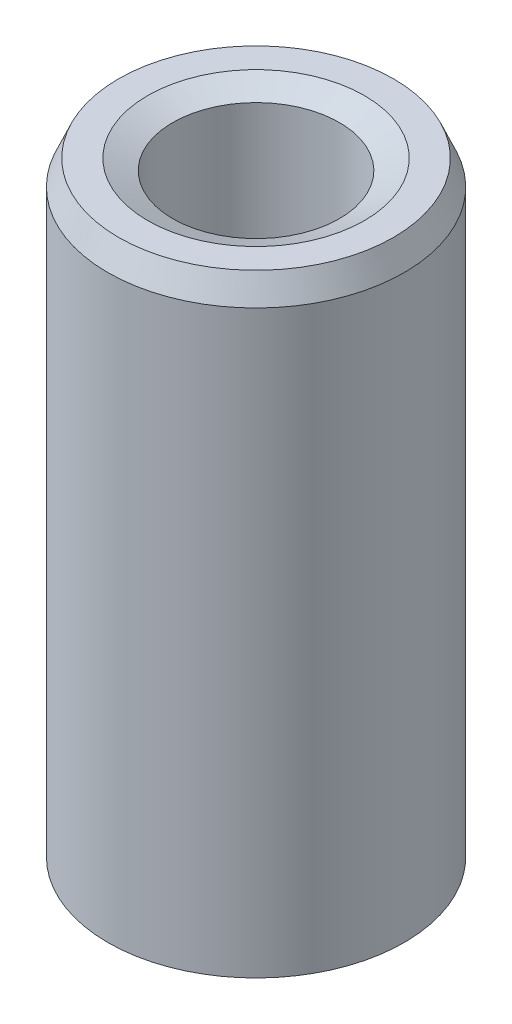
ISO-10303-21;
HEADER;
FILE_DESCRIPTION(('STEP AP214'),'2;1');
FILE_NAME('part.step','',(''),(''),'','','');
FILE_SCHEMA(('AUTOMOTIVE_DESIGN { 1 0 10303 214 1 1 1 1 }'));
ENDSEC;
DATA;
#1=APPLICATION_CONTEXT('core data for automotive mechanical design processes');
#2=APPLICATION_PROTOCOL_DEFINITION('international standard','automotive_design',2000,#1);
#3=PRODUCT_CONTEXT('',#1,'mechanical');
#4=PRODUCT('Part','Part','',(#3));
#5=PRODUCT_RELATED_PRODUCT_CATEGORY('part','',(#4));
#6=PRODUCT_DEFINITION_FORMATION('','',#4);
#7=PRODUCT_DEFINITION_CONTEXT('part definition',#1,'design');
#8=PRODUCT_DEFINITION('design','',#6,#7);
#9=PRODUCT_DEFINITION_SHAPE('','',#8);
#10=(LENGTH_UNIT() NAMED_UNIT(*) SI_UNIT(.MILLI.,.METRE.));
#11=(NAMED_UNIT(*) PLANE_ANGLE_UNIT() SI_UNIT($,.RADIAN.));
#12=(NAMED_UNIT(*) SI_UNIT($,.STERADIAN.) SOLID_ANGLE_UNIT());
#13=UNCERTAINTY_MEASURE_WITH_UNIT(LENGTH_MEASURE(1.E-05),#10,'distance_accuracy_value','');
#14=(GEOMETRIC_REPRESENTATION_CONTEXT(3) GLOBAL_UNCERTAINTY_ASSIGNED_CONTEXT((#13)) GLOBAL_UNIT_ASSIGNED_CONTEXT((#10,
#11,#12)) REPRESENTATION_CONTEXT('',''));
#15=CARTESIAN_POINT('',(0.,0.,0.));
#16=DIRECTION('',(0.,0.,1.));
#17=DIRECTION('',(1.,0.,0.));
#18=AXIS2_PLACEMENT_3D('',#15,#16,#17);
#19=CARTESIAN_POINT('',(0.,93.4970620345878,0.));
#20=DIRECTION('',(0.,-1.,0.));
#21=DIRECTION('',(0.,0.,-1.));
#22=AXIS2_PLACEMENT_3D('',#19,#20,#21);
#23=CYLINDRICAL_SURFACE('',#22,22.5);
#24=CARTESIAN_POINT('',(0.,1.64294532672776,0.));
#25=DIRECTION('',(0.,1.,0.));
#26=DIRECTION('',(0.,0.,1.));
#27=AXIS2_PLACEMENT_3D('',#24,#25,#26);
#28=CIRCLE('',#27,22.5);
#29=CARTESIAN_POINT('',(0.,1.64294532672776,22.5));
#30=VERTEX_POINT('',#29);
#31=EDGE_CURVE('E10',#30,#30,#28,.T.);
#32=ORIENTED_EDGE('',*,*,#31,.T.);
#33=EDGE_LOOP('',(#32));
#34=FACE_BOUND('',#33,.T.);
#35=CARTESIAN_POINT('',(0.,89.7003435880698,0.));
#36=DIRECTION('',(0.,1.,0.));
#37=DIRECTION('',(0.,0.,1.));
#38=AXIS2_PLACEMENT_3D('',#35,#36,#37);
#39=CIRCLE('',#38,22.5);
#40=CARTESIAN_POINT('',(0.,89.7003435880698,22.5));
#41=VERTEX_POINT('',#40);
#42=EDGE_CURVE('E50',#41,#41,#39,.F.);
#43=ORIENTED_EDGE('',*,*,#42,.T.);
#44=EDGE_LOOP('',(#43));
#45=FACE_BOUND('',#44,.T.);
#46=ADVANCED_FACE('F39',(#34,#45),#23,.T.);
#47=CARTESIAN_POINT('',(0.,93.4970620345878,0.));
#48=DIRECTION('',(0.,1.,0.));
#49=DIRECTION('',(0.,0.,1.));
#50=AXIS2_PLACEMENT_3D('',#47,#48,#49);
#51=PLANE('',#50);
#52=CARTESIAN_POINT('',(0.,93.4970620345878,0.));
#53=DIRECTION('',(0.,1.,0.));
#54=DIRECTION('',(0.,0.,1.));
#55=AXIS2_PLACEMENT_3D('',#52,#53,#54);
#56=CIRCLE('',#55,16.4434256580655);
#57=CARTESIAN_POINT('',(0.,93.4970620345878,16.4434256580655));
#58=VERTEX_POINT('',#57);
#59=EDGE_CURVE('E58',#58,#58,#56,.F.);
#60=ORIENTED_EDGE('',*,*,#59,.T.);
#61=EDGE_LOOP('',(#60));
#62=FACE_BOUND('',#61,.T.);
#63=CARTESIAN_POINT('',(0.,93.4970620345878,0.));
#64=DIRECTION('',(0.,1.,0.));
#65=DIRECTION('',(0.,0.,1.));
#66=AXIS2_PLACEMENT_3D('',#63,#64,#65);
#67=CIRCLE('',#66,20.8570546732723);
#68=CARTESIAN_POINT('',(0.,93.4970620345878,20.8570546732723));
#69=VERTEX_POINT('',#68);
#70=EDGE_CURVE('E61',#69,#69,#67,.T.);
#71=ORIENTED_EDGE('',*,*,#70,.T.);
#72=EDGE_LOOP('',(#71));
#73=FACE_BOUND('',#72,.T.);
#74=ADVANCED_FACE('F88',(#62,#73),#51,.T.);
#75=CARTESIAN_POINT('',(0.,0.,0.));
#76=DIRECTION('',(0.,1.,0.));
#77=DIRECTION('',(0.,0.,1.));
#78=AXIS2_PLACEMENT_3D('',#75,#76,#77);
#79=PLANE('',#78);
#80=CARTESIAN_POINT('',(0.,0.,0.));
#81=DIRECTION('',(0.,1.,0.));
#82=DIRECTION('',(0.,0.,1.));
#83=AXIS2_PLACEMENT_3D('',#80,#81,#82);
#84=CIRCLE('',#83,14.2896525382752);
#85=CARTESIAN_POINT('',(0.,0.,14.2896525382752));
#86=VERTEX_POINT('',#85);
#87=EDGE_CURVE('E51',#86,#86,#84,.T.);
#88=ORIENTED_EDGE('',*,*,#87,.T.);
#89=EDGE_LOOP('',(#88));
#90=FACE_BOUND('',#89,.T.);
#91=CARTESIAN_POINT('',(0.,0.,0.));
#92=DIRECTION('',(0.,1.,0.));
#93=DIRECTION('',(0.,0.,1.));
#94=AXIS2_PLACEMENT_3D('',#91,#92,#93);
#95=CIRCLE('',#94,18.703281553482);
#96=CARTESIAN_POINT('',(0.,0.,18.703281553482));
#97=VERTEX_POINT('',#96);
#98=EDGE_CURVE('E54',#97,#97,#95,.F.);
#99=ORIENTED_EDGE('',*,*,#98,.T.);
#100=EDGE_LOOP('',(#99));
#101=FACE_BOUND('',#100,.T.);
#102=ADVANCED_FACE('F83',(#90,#101),#79,.F.);
#103=CARTESIAN_POINT('',(0.,93.4970620345878,0.));
#104=DIRECTION('',(0.,-1.,0.));
#105=DIRECTION('',(0.,0.,-1.));
#106=AXIS2_PLACEMENT_3D('',#103,#104,#105);
#107=CYLINDRICAL_SURFACE('',#106,12.6467072115474);
#108=CARTESIAN_POINT('',(0.,91.8541167078601,0.));
#109=DIRECTION('',(0.,1.,0.));
#110=DIRECTION('',(0.,0.,1.));
#111=AXIS2_PLACEMENT_3D('',#108,#109,#110);
#112=CIRCLE('',#111,12.6467072115474);
#113=CARTESIAN_POINT('',(0.,91.8541167078601,12.6467072115474));
#114=VERTEX_POINT('',#113);
#115=EDGE_CURVE('E67',#114,#114,#112,.T.);
#116=ORIENTED_EDGE('',*,*,#115,.T.);
#117=EDGE_LOOP('',(#116));
#118=FACE_BOUND('',#117,.T.);
#119=CARTESIAN_POINT('',(0.,3.79671844651805,0.));
#120=DIRECTION('',(0.,1.,0.));
#121=DIRECTION('',(0.,0.,1.));
#122=AXIS2_PLACEMENT_3D('',#119,#120,#121);
#123=CIRCLE('',#122,12.6467072115474);
#124=CARTESIAN_POINT('',(0.,3.79671844651805,12.6467072115474));
#125=VERTEX_POINT('',#124);
#126=EDGE_CURVE('E69',#125,#125,#123,.F.);
#127=ORIENTED_EDGE('',*,*,#126,.T.);
#128=EDGE_LOOP('',(#127));
#129=FACE_BOUND('',#128,.T.);
#130=ADVANCED_FACE('F71',(#118,#129),#107,.F.);
#131=CARTESIAN_POINT('',(0.,91.8541167078601,0.));
#132=DIRECTION('',(0.,1.,0.));
#133=DIRECTION('',(0.,0.,1.));
#134=AXIS2_PLACEMENT_3D('',#131,#132,#133);
#135=CONICAL_SURFACE('',#134,12.6467072115474,1.16239847919227);
#136=ORIENTED_EDGE('',*,*,#59,.F.);
#137=EDGE_LOOP('',(#136));
#138=FACE_BOUND('',#137,.T.);
#139=ORIENTED_EDGE('',*,*,#115,.F.);
#140=EDGE_LOOP('',(#139));
#141=FACE_BOUND('',#140,.T.);
#142=ADVANCED_FACE('F77',(#138,#141),#135,.F.);
#143=CARTESIAN_POINT('',(0.,0.,0.));
#144=DIRECTION('',(0.,-1.,0.));
#145=DIRECTION('',(0.,0.,-1.));
#146=AXIS2_PLACEMENT_3D('',#143,#144,#145);
#147=CONICAL_SURFACE('',#146,14.2896525382752,0.408397847602628);
#148=ORIENTED_EDGE('',*,*,#126,.F.);
#149=EDGE_LOOP('',(#148));
#150=FACE_BOUND('',#149,.T.);
#151=ORIENTED_EDGE('',*,*,#87,.F.);
#152=EDGE_LOOP('',(#151));
#153=FACE_BOUND('',#152,.T.);
#154=ADVANCED_FACE('F73',(#150,#153),#147,.F.);
#155=CARTESIAN_POINT('',(0.,1.64294532672776,0.));
#156=DIRECTION('',(0.,1.,0.));
#157=DIRECTION('',(0.,0.,1.));
#158=AXIS2_PLACEMENT_3D('',#155,#156,#157);
#159=CONICAL_SURFACE('',#158,22.5,1.16239847919227);
#160=ORIENTED_EDGE('',*,*,#98,.F.);
#161=EDGE_LOOP('',(#160));
#162=FACE_BOUND('',#161,.T.);
#163=ORIENTED_EDGE('',*,*,#31,.F.);
#164=EDGE_LOOP('',(#163));
#165=FACE_BOUND('',#164,.T.);
#166=ADVANCED_FACE('F76',(#162,#165),#159,.T.);
#167=CARTESIAN_POINT('',(0.,93.4970620345878,0.));
#168=DIRECTION('',(0.,-1.,0.));
#169=DIRECTION('',(0.,0.,-1.));
#170=AXIS2_PLACEMENT_3D('',#167,#168,#169);
#171=CONICAL_SURFACE('',#170,20.8570546732723,0.408397847602628);
#172=ORIENTED_EDGE('',*,*,#42,.F.);
#173=EDGE_LOOP('',(#172));
#174=FACE_BOUND('',#173,.T.);
#175=ORIENTED_EDGE('',*,*,#70,.F.);
#176=EDGE_LOOP('',(#175));
#177=FACE_BOUND('',#176,.T.);
#178=ADVANCED_FACE('F45',(#174,#177),#171,.T.);
#179=CLOSED_SHELL('',(#46,#74,#102,#130,#142,#154,#166,#178));
#180=MANIFOLD_SOLID_BREP('B2',#179);
#181=ADVANCED_BREP_SHAPE_REPRESENTATION('',(#18,#180),#14);
#182=SHAPE_DEFINITION_REPRESENTATION(#9,#181);
ENDSEC;
END-ISO-10303-21;
